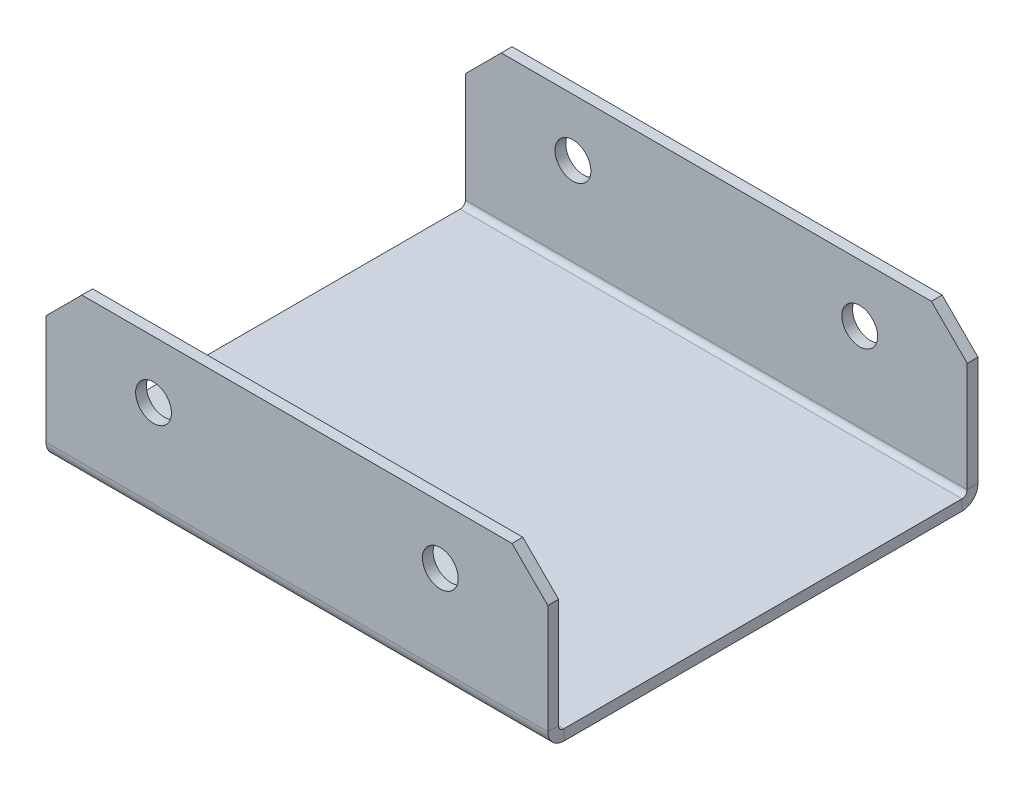
ISO-10303-21;
HEADER;
FILE_DESCRIPTION(('STEP AP214'),'2;1');
FILE_NAME('part.step','',(''),(''),'','','');
FILE_SCHEMA(('AUTOMOTIVE_DESIGN { 1 0 10303 214 1 1 1 1 }'));
ENDSEC;
DATA;
#1=APPLICATION_CONTEXT('core data for automotive mechanical design processes');
#2=APPLICATION_PROTOCOL_DEFINITION('international standard','automotive_design',2000,#1);
#3=PRODUCT_CONTEXT('',#1,'mechanical');
#4=PRODUCT('Part','Part','',(#3));
#5=PRODUCT_RELATED_PRODUCT_CATEGORY('part','',(#4));
#6=PRODUCT_DEFINITION_FORMATION('','',#4);
#7=PRODUCT_DEFINITION_CONTEXT('part definition',#1,'design');
#8=PRODUCT_DEFINITION('design','',#6,#7);
#9=PRODUCT_DEFINITION_SHAPE('','',#8);
#10=(LENGTH_UNIT() NAMED_UNIT(*) SI_UNIT(.MILLI.,.METRE.));
#11=(NAMED_UNIT(*) PLANE_ANGLE_UNIT() SI_UNIT($,.RADIAN.));
#12=(NAMED_UNIT(*) SI_UNIT($,.STERADIAN.) SOLID_ANGLE_UNIT());
#13=UNCERTAINTY_MEASURE_WITH_UNIT(LENGTH_MEASURE(1.E-05),#10,'distance_accuracy_value','');
#14=(GEOMETRIC_REPRESENTATION_CONTEXT(3) GLOBAL_UNCERTAINTY_ASSIGNED_CONTEXT((#13)) GLOBAL_UNIT_ASSIGNED_CONTEXT((#10,
#11,#12)) REPRESENTATION_CONTEXT('',''));
#15=CARTESIAN_POINT('',(0.,0.,0.));
#16=DIRECTION('',(0.,0.,1.));
#17=DIRECTION('',(1.,0.,0.));
#18=AXIS2_PLACEMENT_3D('',#15,#16,#17);
#19=CARTESIAN_POINT('',(0.,-1.5,0.));
#20=DIRECTION('',(0.,1.,0.));
#21=DIRECTION('',(0.,0.,1.));
#22=AXIS2_PLACEMENT_3D('',#19,#20,#21);
#23=PLANE('',#22);
#24=DIRECTION('',(-1.,0.,0.));
#25=VECTOR('',#24,1.);
#26=CARTESIAN_POINT('',(-35.,-1.50000000000001,-27.7634));
#27=LINE('',#26,#25);
#28=CARTESIAN_POINT('',(-35.,-1.50000000000001,-27.7634));
#29=VERTEX_POINT('',#28);
#30=CARTESIAN_POINT('',(35.,-1.5,-27.7634));
#31=VERTEX_POINT('',#30);
#32=EDGE_CURVE('E203',#29,#31,#27,.F.);
#33=ORIENTED_EDGE('',*,*,#32,.T.);
#34=DIRECTION('',(0.,0.,-1.));
#35=VECTOR('',#34,1.);
#36=CARTESIAN_POINT('',(35.,-1.5,30.));
#37=LINE('',#36,#35);
#38=CARTESIAN_POINT('',(35.,-1.5,27.7634));
#39=VERTEX_POINT('',#38);
#40=EDGE_CURVE('E310',#39,#31,#37,.T.);
#41=ORIENTED_EDGE('',*,*,#40,.F.);
#42=DIRECTION('',(1.,0.,0.));
#43=VECTOR('',#42,1.);
#44=CARTESIAN_POINT('',(35.,-1.5,27.7634));
#45=LINE('',#44,#43);
#46=CARTESIAN_POINT('',(-35.,-1.5,27.7634));
#47=VERTEX_POINT('',#46);
#48=EDGE_CURVE('E284',#39,#47,#45,.F.);
#49=ORIENTED_EDGE('',*,*,#48,.T.);
#50=DIRECTION('',(0.,0.,1.));
#51=VECTOR('',#50,1.);
#52=CARTESIAN_POINT('',(-35.,-1.5,30.));
#53=LINE('',#52,#51);
#54=EDGE_CURVE('E308',#29,#47,#53,.T.);
#55=ORIENTED_EDGE('',*,*,#54,.F.);
#56=EDGE_LOOP('',(#33,#41,#49,#55));
#57=FACE_BOUND('',#56,.T.);
#58=ADVANCED_FACE('F79',(#57),#23,.F.);
#59=CARTESIAN_POINT('',(0.,0.,0.));
#60=DIRECTION('',(0.,1.,0.));
#61=DIRECTION('',(0.,0.,1.));
#62=AXIS2_PLACEMENT_3D('',#59,#60,#61);
#63=PLANE('',#62);
#64=DIRECTION('',(0.,0.,-1.));
#65=VECTOR('',#64,1.);
#66=CARTESIAN_POINT('',(35.,0.,30.));
#67=LINE('',#66,#65);
#68=CARTESIAN_POINT('',(35.,0.,27.7634));
#69=VERTEX_POINT('',#68);
#70=CARTESIAN_POINT('',(35.,0.,-27.7634));
#71=VERTEX_POINT('',#70);
#72=EDGE_CURVE('E311',#69,#71,#67,.T.);
#73=ORIENTED_EDGE('',*,*,#72,.T.);
#74=DIRECTION('',(-1.,0.,0.));
#75=VECTOR('',#74,1.);
#76=CARTESIAN_POINT('',(-35.,0.,-27.7634));
#77=LINE('',#76,#75);
#78=CARTESIAN_POINT('',(-35.,0.,-27.7634));
#79=VERTEX_POINT('',#78);
#80=EDGE_CURVE('E247',#79,#71,#77,.F.);
#81=ORIENTED_EDGE('',*,*,#80,.F.);
#82=DIRECTION('',(0.,0.,1.));
#83=VECTOR('',#82,1.);
#84=CARTESIAN_POINT('',(-35.,0.,30.));
#85=LINE('',#84,#83);
#86=CARTESIAN_POINT('',(-35.,0.,27.7634));
#87=VERTEX_POINT('',#86);
#88=EDGE_CURVE('E305',#79,#87,#85,.T.);
#89=ORIENTED_EDGE('',*,*,#88,.T.);
#90=DIRECTION('',(1.,0.,0.));
#91=VECTOR('',#90,1.);
#92=CARTESIAN_POINT('',(35.,0.,27.7634));
#93=LINE('',#92,#91);
#94=EDGE_CURVE('E297',#69,#87,#93,.F.);
#95=ORIENTED_EDGE('',*,*,#94,.F.);
#96=EDGE_LOOP('',(#73,#81,#89,#95));
#97=FACE_BOUND('',#96,.T.);
#98=ADVANCED_FACE('F409',(#97),#63,.T.);
#99=CARTESIAN_POINT('',(-35.,-1.5,30.));
#100=DIRECTION('',(-1.,0.,0.));
#101=DIRECTION('',(0.,0.,1.));
#102=AXIS2_PLACEMENT_3D('',#99,#100,#101);
#103=PLANE('',#102);
#104=ORIENTED_EDGE('',*,*,#88,.F.);
#105=DIRECTION('',(0.,-1.,0.));
#106=VECTOR('',#105,1.);
#107=CARTESIAN_POINT('',(-35.,0.,-27.7634));
#108=LINE('',#107,#106);
#109=EDGE_CURVE('E243',#79,#29,#108,.T.);
#110=ORIENTED_EDGE('',*,*,#109,.T.);
#111=ORIENTED_EDGE('',*,*,#54,.T.);
#112=DIRECTION('',(0.,-1.,0.));
#113=VECTOR('',#112,1.);
#114=CARTESIAN_POINT('',(-35.,0.,27.7634));
#115=LINE('',#114,#113);
#116=EDGE_CURVE('E302',#87,#47,#115,.T.);
#117=ORIENTED_EDGE('',*,*,#116,.F.);
#118=EDGE_LOOP('',(#104,#110,#111,#117));
#119=FACE_BOUND('',#118,.T.);
#120=ADVANCED_FACE('F415',(#119),#103,.T.);
#121=CARTESIAN_POINT('',(35.,-1.5,30.));
#122=DIRECTION('',(1.,0.,0.));
#123=DIRECTION('',(0.,0.,-1.));
#124=AXIS2_PLACEMENT_3D('',#121,#122,#123);
#125=PLANE('',#124);
#126=DIRECTION('',(0.,-1.,0.));
#127=VECTOR('',#126,1.);
#128=CARTESIAN_POINT('',(35.,0.,-27.7634));
#129=LINE('',#128,#127);
#130=EDGE_CURVE('E251',#71,#31,#129,.T.);
#131=ORIENTED_EDGE('',*,*,#130,.F.);
#132=ORIENTED_EDGE('',*,*,#72,.F.);
#133=DIRECTION('',(0.,-1.,0.));
#134=VECTOR('',#133,1.);
#135=CARTESIAN_POINT('',(35.,0.,27.7634));
#136=LINE('',#135,#134);
#137=EDGE_CURVE('E291',#69,#39,#136,.T.);
#138=ORIENTED_EDGE('',*,*,#137,.T.);
#139=ORIENTED_EDGE('',*,*,#40,.T.);
#140=EDGE_LOOP('',(#131,#132,#138,#139));
#141=FACE_BOUND('',#140,.T.);
#142=ADVANCED_FACE('F422',(#141),#125,.T.);
#143=CARTESIAN_POINT('',(-35.,0.736599999999997,27.7634));
#144=DIRECTION('',(-1.,0.,0.));
#145=DIRECTION('',(0.,0.,1.));
#146=AXIS2_PLACEMENT_3D('',#143,#144,#145);
#147=PLANE('',#146);
#148=DIRECTION('',(0.,0.,-1.));
#149=VECTOR('',#148,1.);
#150=CARTESIAN_POINT('',(-35.,0.736599999999997,30.));
#151=LINE('',#150,#149);
#152=CARTESIAN_POINT('',(-35.,0.736599999999997,28.5));
#153=VERTEX_POINT('',#152);
#154=CARTESIAN_POINT('',(-35.,0.736599999999997,30.));
#155=VERTEX_POINT('',#154);
#156=EDGE_CURVE('E254',#153,#155,#151,.F.);
#157=ORIENTED_EDGE('',*,*,#156,.F.);
#158=CARTESIAN_POINT('',(-35.,0.736599999999997,27.7634));
#159=DIRECTION('',(1.,0.,0.));
#160=DIRECTION('',(0.,0.,-1.));
#161=AXIS2_PLACEMENT_3D('',#158,#159,#160);
#162=CIRCLE('',#161,0.7366);
#163=EDGE_CURVE('E294',#87,#153,#162,.F.);
#164=ORIENTED_EDGE('',*,*,#163,.F.);
#165=ORIENTED_EDGE('',*,*,#116,.T.);
#166=CARTESIAN_POINT('',(-35.,0.736599999999997,27.7634));
#167=DIRECTION('',(1.,0.,0.));
#168=DIRECTION('',(0.,0.,-1.));
#169=AXIS2_PLACEMENT_3D('',#166,#167,#168);
#170=CIRCLE('',#169,2.2366);
#171=EDGE_CURVE('E287',#47,#155,#170,.F.);
#172=ORIENTED_EDGE('',*,*,#171,.T.);
#173=EDGE_LOOP('',(#157,#164,#165,#172));
#174=FACE_BOUND('',#173,.T.);
#175=ADVANCED_FACE('F425',(#174),#147,.T.);
#176=CARTESIAN_POINT('',(35.,0.736599999999997,27.7634));
#177=DIRECTION('',(-1.,0.,0.));
#178=DIRECTION('',(0.,0.,1.));
#179=AXIS2_PLACEMENT_3D('',#176,#177,#178);
#180=PLANE('',#179);
#181=CARTESIAN_POINT('',(35.,0.736599999999997,27.7634));
#182=DIRECTION('',(1.,0.,0.));
#183=DIRECTION('',(0.,0.,-1.));
#184=AXIS2_PLACEMENT_3D('',#181,#182,#183);
#185=CIRCLE('',#184,0.7366);
#186=CARTESIAN_POINT('',(35.,0.736599999999997,28.5));
#187=VERTEX_POINT('',#186);
#188=EDGE_CURVE('E260',#187,#69,#185,.T.);
#189=ORIENTED_EDGE('',*,*,#188,.F.);
#190=DIRECTION('',(0.,0.,-1.));
#191=VECTOR('',#190,1.);
#192=CARTESIAN_POINT('',(35.,0.736599999999997,28.5));
#193=LINE('',#192,#191);
#194=CARTESIAN_POINT('',(35.,0.736599999999997,30.));
#195=VERTEX_POINT('',#194);
#196=EDGE_CURVE('E277',#187,#195,#193,.F.);
#197=ORIENTED_EDGE('',*,*,#196,.T.);
#198=CARTESIAN_POINT('',(35.,0.736599999999997,27.7634));
#199=DIRECTION('',(1.,0.,0.));
#200=DIRECTION('',(0.,0.,-1.));
#201=AXIS2_PLACEMENT_3D('',#198,#199,#200);
#202=CIRCLE('',#201,2.2366);
#203=EDGE_CURVE('E288',#195,#39,#202,.T.);
#204=ORIENTED_EDGE('',*,*,#203,.T.);
#205=ORIENTED_EDGE('',*,*,#137,.F.);
#206=EDGE_LOOP('',(#189,#197,#204,#205));
#207=FACE_BOUND('',#206,.T.);
#208=ADVANCED_FACE('F419',(#207),#180,.F.);
#209=CARTESIAN_POINT('',(35.,0.736599999999997,27.7634));
#210=DIRECTION('',(1.,0.,0.));
#211=DIRECTION('',(0.,0.,1.));
#212=AXIS2_PLACEMENT_3D('',#209,#210,#211);
#213=CYLINDRICAL_SURFACE('',#212,2.2366);
#214=ORIENTED_EDGE('',*,*,#48,.F.);
#215=ORIENTED_EDGE('',*,*,#203,.F.);
#216=DIRECTION('',(1.,0.,0.));
#217=VECTOR('',#216,1.);
#218=CARTESIAN_POINT('',(-35.,0.736599999999997,30.));
#219=LINE('',#218,#217);
#220=EDGE_CURVE('E274',#195,#155,#219,.F.);
#221=ORIENTED_EDGE('',*,*,#220,.T.);
#222=ORIENTED_EDGE('',*,*,#171,.F.);
#223=EDGE_LOOP('',(#214,#215,#221,#222));
#224=FACE_BOUND('',#223,.T.);
#225=ADVANCED_FACE('F482',(#224),#213,.T.);
#226=CARTESIAN_POINT('',(35.,0.736599999999997,27.7634));
#227=DIRECTION('',(1.,0.,0.));
#228=DIRECTION('',(0.,0.,1.));
#229=AXIS2_PLACEMENT_3D('',#226,#227,#228);
#230=CYLINDRICAL_SURFACE('',#229,0.7366);
#231=ORIENTED_EDGE('',*,*,#94,.T.);
#232=ORIENTED_EDGE('',*,*,#163,.T.);
#233=DIRECTION('',(1.,0.,0.));
#234=VECTOR('',#233,1.);
#235=CARTESIAN_POINT('',(-35.,0.736599999999997,28.5));
#236=LINE('',#235,#234);
#237=EDGE_CURVE('E280',#153,#187,#236,.T.);
#238=ORIENTED_EDGE('',*,*,#237,.T.);
#239=ORIENTED_EDGE('',*,*,#188,.T.);
#240=EDGE_LOOP('',(#231,#232,#238,#239));
#241=FACE_BOUND('',#240,.T.);
#242=ADVANCED_FACE('F470',(#241),#230,.F.);
#243=CARTESIAN_POINT('',(-35.,0.,30.));
#244=DIRECTION('',(1.,0.,0.));
#245=DIRECTION('',(0.,0.,-1.));
#246=AXIS2_PLACEMENT_3D('',#243,#244,#245);
#247=PLANE('',#246);
#248=DIRECTION('',(0.,-1.,0.));
#249=VECTOR('',#248,1.);
#250=CARTESIAN_POINT('',(-35.,0.,30.));
#251=LINE('',#250,#249);
#252=CARTESIAN_POINT('',(-35.,16.,30.));
#253=VERTEX_POINT('',#252);
#254=EDGE_CURVE('E264',#253,#155,#251,.T.);
#255=ORIENTED_EDGE('',*,*,#254,.F.);
#256=DIRECTION('',(0.,0.,-1.));
#257=VECTOR('',#256,1.);
#258=CARTESIAN_POINT('',(-35.,16.,30.));
#259=LINE('',#258,#257);
#260=CARTESIAN_POINT('',(-35.,16.,28.5));
#261=VERTEX_POINT('',#260);
#262=EDGE_CURVE('E326',#253,#261,#259,.T.);
#263=ORIENTED_EDGE('',*,*,#262,.T.);
#264=DIRECTION('',(0.,1.,0.));
#265=VECTOR('',#264,1.);
#266=CARTESIAN_POINT('',(-35.,0.,28.5));
#267=LINE('',#266,#265);
#268=EDGE_CURVE('E272',#261,#153,#267,.F.);
#269=ORIENTED_EDGE('',*,*,#268,.T.);
#270=ORIENTED_EDGE('',*,*,#156,.T.);
#271=EDGE_LOOP('',(#255,#263,#269,#270));
#272=FACE_BOUND('',#271,.T.);
#273=ADVANCED_FACE('F462',(#272),#247,.F.);
#274=CARTESIAN_POINT('',(35.,21.,30.));
#275=DIRECTION('',(-1.,0.,0.));
#276=DIRECTION('',(0.,-1.,0.));
#277=AXIS2_PLACEMENT_3D('',#274,#275,#276);
#278=PLANE('',#277);
#279=DIRECTION('',(0.,-1.,0.));
#280=VECTOR('',#279,1.);
#281=CARTESIAN_POINT('',(35.,21.,28.5));
#282=LINE('',#281,#280);
#283=CARTESIAN_POINT('',(35.,16.,28.5));
#284=VERTEX_POINT('',#283);
#285=EDGE_CURVE('E269',#187,#284,#282,.F.);
#286=ORIENTED_EDGE('',*,*,#285,.T.);
#287=DIRECTION('',(0.,0.,1.));
#288=VECTOR('',#287,1.);
#289=CARTESIAN_POINT('',(35.,16.,30.));
#290=LINE('',#289,#288);
#291=CARTESIAN_POINT('',(35.,16.,30.));
#292=VERTEX_POINT('',#291);
#293=EDGE_CURVE('E322',#284,#292,#290,.T.);
#294=ORIENTED_EDGE('',*,*,#293,.T.);
#295=DIRECTION('',(0.,1.,0.));
#296=VECTOR('',#295,1.);
#297=CARTESIAN_POINT('',(35.,0.,30.));
#298=LINE('',#297,#296);
#299=EDGE_CURVE('E261',#195,#292,#298,.T.);
#300=ORIENTED_EDGE('',*,*,#299,.F.);
#301=ORIENTED_EDGE('',*,*,#196,.F.);
#302=EDGE_LOOP('',(#286,#294,#300,#301));
#303=FACE_BOUND('',#302,.T.);
#304=ADVANCED_FACE('F477',(#303),#278,.F.);
#305=CARTESIAN_POINT('',(0.,0.,30.));
#306=DIRECTION('',(0.,0.,-1.));
#307=DIRECTION('',(-1.,0.,0.));
#308=AXIS2_PLACEMENT_3D('',#305,#306,#307);
#309=PLANE('',#308);
#310=CARTESIAN_POINT('',(20.,13.,30.));
#311=DIRECTION('',(0.,0.,1.));
#312=DIRECTION('',(1.,0.,0.));
#313=AXIS2_PLACEMENT_3D('',#310,#311,#312);
#314=CIRCLE('',#313,2.5);
#315=CARTESIAN_POINT('',(22.5,13.,30.));
#316=VERTEX_POINT('',#315);
#317=EDGE_CURVE('E359',#316,#316,#314,.T.);
#318=ORIENTED_EDGE('',*,*,#317,.F.);
#319=EDGE_LOOP('',(#318));
#320=FACE_BOUND('',#319,.T.);
#321=CARTESIAN_POINT('',(-20.,13.,30.));
#322=DIRECTION('',(0.,0.,1.));
#323=DIRECTION('',(1.,0.,0.));
#324=AXIS2_PLACEMENT_3D('',#321,#322,#323);
#325=CIRCLE('',#324,2.5);
#326=CARTESIAN_POINT('',(-17.5,13.,30.));
#327=VERTEX_POINT('',#326);
#328=EDGE_CURVE('E364',#327,#327,#325,.T.);
#329=ORIENTED_EDGE('',*,*,#328,.F.);
#330=EDGE_LOOP('',(#329));
#331=FACE_BOUND('',#330,.T.);
#332=DIRECTION('',(-1.,0.,0.));
#333=VECTOR('',#332,1.);
#334=CARTESIAN_POINT('',(0.,21.,30.));
#335=LINE('',#334,#333);
#336=CARTESIAN_POINT('',(30.,21.,30.));
#337=VERTEX_POINT('',#336);
#338=CARTESIAN_POINT('',(-30.,21.,30.));
#339=VERTEX_POINT('',#338);
#340=EDGE_CURVE('E257',#337,#339,#335,.T.);
#341=ORIENTED_EDGE('',*,*,#340,.T.);
#342=DIRECTION('',(0.707106781186548,0.707106781186548,0.));
#343=VECTOR('',#342,1.);
#344=CARTESIAN_POINT('',(-35.,16.,30.));
#345=LINE('',#344,#343);
#346=EDGE_CURVE('E333',#339,#253,#345,.F.);
#347=ORIENTED_EDGE('',*,*,#346,.T.);
#348=ORIENTED_EDGE('',*,*,#254,.T.);
#349=ORIENTED_EDGE('',*,*,#220,.F.);
#350=ORIENTED_EDGE('',*,*,#299,.T.);
#351=DIRECTION('',(0.707106781186548,-0.707106781186547,0.));
#352=VECTOR('',#351,1.);
#353=CARTESIAN_POINT('',(30.,21.,30.));
#354=LINE('',#353,#352);
#355=EDGE_CURVE('E324',#292,#337,#354,.F.);
#356=ORIENTED_EDGE('',*,*,#355,.T.);
#357=EDGE_LOOP('',(#341,#347,#348,#349,#350,#356));
#358=FACE_BOUND('',#357,.T.);
#359=ADVANCED_FACE('F451',(#320,#331,#358),#309,.F.);
#360=CARTESIAN_POINT('',(0.,0.,28.5));
#361=DIRECTION('',(0.,0.,-1.));
#362=DIRECTION('',(-1.,0.,0.));
#363=AXIS2_PLACEMENT_3D('',#360,#361,#362);
#364=PLANE('',#363);
#365=CARTESIAN_POINT('',(20.,13.,28.5));
#366=DIRECTION('',(0.,0.,-1.));
#367=DIRECTION('',(-1.,0.,0.));
#368=AXIS2_PLACEMENT_3D('',#365,#366,#367);
#369=CIRCLE('',#368,2.5);
#370=CARTESIAN_POINT('',(17.5,13.,28.5));
#371=VERTEX_POINT('',#370);
#372=EDGE_CURVE('E240',#371,#371,#369,.T.);
#373=ORIENTED_EDGE('',*,*,#372,.F.);
#374=EDGE_LOOP('',(#373));
#375=FACE_BOUND('',#374,.T.);
#376=CARTESIAN_POINT('',(-20.,13.,28.5));
#377=DIRECTION('',(0.,0.,-1.));
#378=DIRECTION('',(-1.,0.,0.));
#379=AXIS2_PLACEMENT_3D('',#376,#377,#378);
#380=CIRCLE('',#379,2.5);
#381=CARTESIAN_POINT('',(-22.5,13.,28.5));
#382=VERTEX_POINT('',#381);
#383=EDGE_CURVE('E352',#382,#382,#380,.T.);
#384=ORIENTED_EDGE('',*,*,#383,.F.);
#385=EDGE_LOOP('',(#384));
#386=FACE_BOUND('',#385,.T.);
#387=ORIENTED_EDGE('',*,*,#268,.F.);
#388=DIRECTION('',(-0.707106781186548,-0.707106781186548,0.));
#389=VECTOR('',#388,1.);
#390=CARTESIAN_POINT('',(-25.5,25.5,28.5));
#391=LINE('',#390,#389);
#392=CARTESIAN_POINT('',(-30.,21.,28.5));
#393=VERTEX_POINT('',#392);
#394=EDGE_CURVE('E329',#261,#393,#391,.F.);
#395=ORIENTED_EDGE('',*,*,#394,.T.);
#396=DIRECTION('',(1.,0.,0.));
#397=VECTOR('',#396,1.);
#398=CARTESIAN_POINT('',(-35.,21.,28.5));
#399=LINE('',#398,#397);
#400=CARTESIAN_POINT('',(30.,21.,28.5));
#401=VERTEX_POINT('',#400);
#402=EDGE_CURVE('E266',#401,#393,#399,.F.);
#403=ORIENTED_EDGE('',*,*,#402,.F.);
#404=DIRECTION('',(-0.707106781186548,0.707106781186547,0.));
#405=VECTOR('',#404,1.);
#406=CARTESIAN_POINT('',(25.5,25.5,28.5));
#407=LINE('',#406,#405);
#408=EDGE_CURVE('E320',#401,#284,#407,.F.);
#409=ORIENTED_EDGE('',*,*,#408,.T.);
#410=ORIENTED_EDGE('',*,*,#285,.F.);
#411=ORIENTED_EDGE('',*,*,#237,.F.);
#412=EDGE_LOOP('',(#387,#395,#403,#409,#410,#411));
#413=FACE_BOUND('',#412,.T.);
#414=ADVANCED_FACE('F474',(#375,#386,#413),#364,.T.);
#415=CARTESIAN_POINT('',(-35.,21.,30.));
#416=DIRECTION('',(0.,-1.,0.));
#417=DIRECTION('',(0.,0.,-1.));
#418=AXIS2_PLACEMENT_3D('',#415,#416,#417);
#419=PLANE('',#418);
#420=ORIENTED_EDGE('',*,*,#402,.T.);
#421=DIRECTION('',(0.,0.,1.));
#422=VECTOR('',#421,1.);
#423=CARTESIAN_POINT('',(-30.,21.,30.));
#424=LINE('',#423,#422);
#425=EDGE_CURVE('E331',#393,#339,#424,.T.);
#426=ORIENTED_EDGE('',*,*,#425,.T.);
#427=ORIENTED_EDGE('',*,*,#340,.F.);
#428=DIRECTION('',(0.,0.,-1.));
#429=VECTOR('',#428,1.);
#430=CARTESIAN_POINT('',(30.,21.,30.));
#431=LINE('',#430,#429);
#432=EDGE_CURVE('E314',#337,#401,#431,.T.);
#433=ORIENTED_EDGE('',*,*,#432,.T.);
#434=EDGE_LOOP('',(#420,#426,#427,#433));
#435=FACE_BOUND('',#434,.T.);
#436=ADVANCED_FACE('F456',(#435),#419,.F.);
#437=CARTESIAN_POINT('',(35.,0.736599999999993,-27.7634));
#438=DIRECTION('',(1.,0.,0.));
#439=DIRECTION('',(0.,1.,0.));
#440=AXIS2_PLACEMENT_3D('',#437,#438,#439);
#441=PLANE('',#440);
#442=DIRECTION('',(0.,0.,1.));
#443=VECTOR('',#442,1.);
#444=CARTESIAN_POINT('',(35.,0.736600000000007,-30.));
#445=LINE('',#444,#443);
#446=CARTESIAN_POINT('',(35.,0.73659999999999,-28.5));
#447=VERTEX_POINT('',#446);
#448=CARTESIAN_POINT('',(35.,0.736599999999985,-30.));
#449=VERTEX_POINT('',#448);
#450=EDGE_CURVE('E237',#447,#449,#445,.F.);
#451=ORIENTED_EDGE('',*,*,#450,.F.);
#452=CARTESIAN_POINT('',(35.,0.736599999999993,-27.7634));
#453=DIRECTION('',(-1.,0.,0.));
#454=DIRECTION('',(0.,-1.,0.));
#455=AXIS2_PLACEMENT_3D('',#452,#453,#454);
#456=CIRCLE('',#455,0.7366);
#457=EDGE_CURVE('E206',#71,#447,#456,.F.);
#458=ORIENTED_EDGE('',*,*,#457,.F.);
#459=ORIENTED_EDGE('',*,*,#130,.T.);
#460=CARTESIAN_POINT('',(35.,0.736599999999993,-27.7634));
#461=DIRECTION('',(-1.,0.,0.));
#462=DIRECTION('',(0.,-1.,0.));
#463=AXIS2_PLACEMENT_3D('',#460,#461,#462);
#464=CIRCLE('',#463,2.2366);
#465=EDGE_CURVE('E242',#31,#449,#464,.F.);
#466=ORIENTED_EDGE('',*,*,#465,.T.);
#467=EDGE_LOOP('',(#451,#458,#459,#466));
#468=FACE_BOUND('',#467,.T.);
#469=ADVANCED_FACE('F490',(#468),#441,.T.);
#470=CARTESIAN_POINT('',(-35.,0.736599999999988,-27.7634));
#471=DIRECTION('',(1.,0.,0.));
#472=DIRECTION('',(0.,1.,0.));
#473=AXIS2_PLACEMENT_3D('',#470,#471,#472);
#474=PLANE('',#473);
#475=CARTESIAN_POINT('',(-35.,0.736599999999988,-27.7634));
#476=DIRECTION('',(-1.,0.,0.));
#477=DIRECTION('',(0.,-1.,0.));
#478=AXIS2_PLACEMENT_3D('',#475,#476,#477);
#479=CIRCLE('',#478,0.7366);
#480=CARTESIAN_POINT('',(-35.,0.736599999999985,-28.5));
#481=VERTEX_POINT('',#480);
#482=EDGE_CURVE('E213',#481,#79,#479,.T.);
#483=ORIENTED_EDGE('',*,*,#482,.F.);
#484=DIRECTION('',(0.,0.,1.));
#485=VECTOR('',#484,1.);
#486=CARTESIAN_POINT('',(-35.,0.736599999999993,-28.5));
#487=LINE('',#486,#485);
#488=CARTESIAN_POINT('',(-35.,0.736600000000004,-30.));
#489=VERTEX_POINT('',#488);
#490=EDGE_CURVE('E210',#481,#489,#487,.F.);
#491=ORIENTED_EDGE('',*,*,#490,.T.);
#492=CARTESIAN_POINT('',(-35.,0.736599999999988,-27.7634));
#493=DIRECTION('',(-1.,0.,0.));
#494=DIRECTION('',(0.,-1.,0.));
#495=AXIS2_PLACEMENT_3D('',#492,#493,#494);
#496=CIRCLE('',#495,2.2366);
#497=EDGE_CURVE('E196',#489,#29,#496,.T.);
#498=ORIENTED_EDGE('',*,*,#497,.T.);
#499=ORIENTED_EDGE('',*,*,#109,.F.);
#500=EDGE_LOOP('',(#483,#491,#498,#499));
#501=FACE_BOUND('',#500,.T.);
#502=ADVANCED_FACE('F211',(#501),#474,.F.);
#503=CARTESIAN_POINT('',(-35.,0.736599999999988,-27.7634));
#504=DIRECTION('',(-1.,0.,0.));
#505=DIRECTION('',(0.,0.,-1.));
#506=AXIS2_PLACEMENT_3D('',#503,#504,#505);
#507=CYLINDRICAL_SURFACE('',#506,2.2366);
#508=ORIENTED_EDGE('',*,*,#32,.F.);
#509=ORIENTED_EDGE('',*,*,#497,.F.);
#510=DIRECTION('',(-1.,0.,0.));
#511=VECTOR('',#510,1.);
#512=CARTESIAN_POINT('',(35.,0.736600000000007,-30.));
#513=LINE('',#512,#511);
#514=EDGE_CURVE('E201',#489,#449,#513,.F.);
#515=ORIENTED_EDGE('',*,*,#514,.T.);
#516=ORIENTED_EDGE('',*,*,#465,.F.);
#517=EDGE_LOOP('',(#508,#509,#515,#516));
#518=FACE_BOUND('',#517,.T.);
#519=ADVANCED_FACE('F198',(#518),#507,.T.);
#520=CARTESIAN_POINT('',(-35.,0.736599999999988,-27.7634));
#521=DIRECTION('',(-1.,0.,0.));
#522=DIRECTION('',(0.,0.,-1.));
#523=AXIS2_PLACEMENT_3D('',#520,#521,#522);
#524=CYLINDRICAL_SURFACE('',#523,0.7366);
#525=ORIENTED_EDGE('',*,*,#80,.T.);
#526=ORIENTED_EDGE('',*,*,#457,.T.);
#527=DIRECTION('',(-1.,0.,0.));
#528=VECTOR('',#527,1.);
#529=CARTESIAN_POINT('',(35.,0.736599999999997,-28.5));
#530=LINE('',#529,#528);
#531=EDGE_CURVE('E214',#447,#481,#530,.T.);
#532=ORIENTED_EDGE('',*,*,#531,.T.);
#533=ORIENTED_EDGE('',*,*,#482,.T.);
#534=EDGE_LOOP('',(#525,#526,#532,#533));
#535=FACE_BOUND('',#534,.T.);
#536=ADVANCED_FACE('F486',(#535),#524,.F.);
#537=CARTESIAN_POINT('',(35.,0.,-30.));
#538=DIRECTION('',(-1.,0.,0.));
#539=DIRECTION('',(0.,0.,1.));
#540=AXIS2_PLACEMENT_3D('',#537,#538,#539);
#541=PLANE('',#540);
#542=DIRECTION('',(0.,-1.,0.));
#543=VECTOR('',#542,1.);
#544=CARTESIAN_POINT('',(35.,-1.09320630566873E-13,-30.));
#545=LINE('',#544,#543);
#546=CARTESIAN_POINT('',(35.,16.,-30.));
#547=VERTEX_POINT('',#546);
#548=EDGE_CURVE('E221',#547,#449,#545,.T.);
#549=ORIENTED_EDGE('',*,*,#548,.F.);
#550=DIRECTION('',(0.,0.,1.));
#551=VECTOR('',#550,1.);
#552=CARTESIAN_POINT('',(35.,16.,-30.));
#553=LINE('',#552,#551);
#554=CARTESIAN_POINT('',(35.,16.,-28.5));
#555=VERTEX_POINT('',#554);
#556=EDGE_CURVE('E335',#547,#555,#553,.T.);
#557=ORIENTED_EDGE('',*,*,#556,.T.);
#558=DIRECTION('',(0.,1.,0.));
#559=VECTOR('',#558,1.);
#560=CARTESIAN_POINT('',(35.,0.,-28.5));
#561=LINE('',#560,#559);
#562=EDGE_CURVE('E222',#555,#447,#561,.F.);
#563=ORIENTED_EDGE('',*,*,#562,.T.);
#564=ORIENTED_EDGE('',*,*,#450,.T.);
#565=EDGE_LOOP('',(#549,#557,#563,#564));
#566=FACE_BOUND('',#565,.T.);
#567=ADVANCED_FACE('F394',(#566),#541,.F.);
#568=CARTESIAN_POINT('',(-35.,21.,-30.0000000000001));
#569=DIRECTION('',(1.,0.,0.));
#570=DIRECTION('',(0.,1.,0.));
#571=AXIS2_PLACEMENT_3D('',#568,#569,#570);
#572=PLANE('',#571);
#573=DIRECTION('',(0.,-1.,0.));
#574=VECTOR('',#573,1.);
#575=CARTESIAN_POINT('',(-35.,21.,-28.5000000000001));
#576=LINE('',#575,#574);
#577=CARTESIAN_POINT('',(-35.,16.,-28.5));
#578=VERTEX_POINT('',#577);
#579=EDGE_CURVE('E233',#481,#578,#576,.F.);
#580=ORIENTED_EDGE('',*,*,#579,.T.);
#581=DIRECTION('',(0.,0.,-1.));
#582=VECTOR('',#581,1.);
#583=CARTESIAN_POINT('',(-35.,16.,-30.));
#584=LINE('',#583,#582);
#585=CARTESIAN_POINT('',(-35.,16.,-30.));
#586=VERTEX_POINT('',#585);
#587=EDGE_CURVE('E89',#578,#586,#584,.T.);
#588=ORIENTED_EDGE('',*,*,#587,.T.);
#589=DIRECTION('',(0.,1.,0.));
#590=VECTOR('',#589,1.);
#591=CARTESIAN_POINT('',(-35.,-1.20885453740052E-13,-30.));
#592=LINE('',#591,#590);
#593=EDGE_CURVE('E218',#489,#586,#592,.T.);
#594=ORIENTED_EDGE('',*,*,#593,.F.);
#595=ORIENTED_EDGE('',*,*,#490,.F.);
#596=EDGE_LOOP('',(#580,#588,#594,#595));
#597=FACE_BOUND('',#596,.T.);
#598=ADVANCED_FACE('F224',(#597),#572,.F.);
#599=CARTESIAN_POINT('',(0.,-1.09320630566873E-13,-30.));
#600=DIRECTION('',(0.,0.,1.));
#601=DIRECTION('',(0.,-1.,0.));
#602=AXIS2_PLACEMENT_3D('',#599,#600,#601);
#603=PLANE('',#602);
#604=CARTESIAN_POINT('',(20.,13.,-30.));
#605=DIRECTION('',(0.,0.,1.));
#606=DIRECTION('',(0.,-1.,0.));
#607=AXIS2_PLACEMENT_3D('',#604,#605,#606);
#608=CIRCLE('',#607,2.5);
#609=CARTESIAN_POINT('',(20.,10.5,-30.));
#610=VERTEX_POINT('',#609);
#611=EDGE_CURVE('E353',#610,#610,#608,.F.);
#612=ORIENTED_EDGE('',*,*,#611,.F.);
#613=EDGE_LOOP('',(#612));
#614=FACE_BOUND('',#613,.T.);
#615=CARTESIAN_POINT('',(-20.,13.,-30.));
#616=DIRECTION('',(0.,0.,1.));
#617=DIRECTION('',(0.,-1.,0.));
#618=AXIS2_PLACEMENT_3D('',#615,#616,#617);
#619=CIRCLE('',#618,2.5);
#620=CARTESIAN_POINT('',(-20.,10.5,-30.));
#621=VERTEX_POINT('',#620);
#622=EDGE_CURVE('E367',#621,#621,#619,.F.);
#623=ORIENTED_EDGE('',*,*,#622,.F.);
#624=EDGE_LOOP('',(#623));
#625=FACE_BOUND('',#624,.T.);
#626=ORIENTED_EDGE('',*,*,#593,.T.);
#627=DIRECTION('',(-0.707106781186548,-0.707106781186547,0.));
#628=VECTOR('',#627,1.);
#629=CARTESIAN_POINT('',(-30.,21.,-30.0000000000001));
#630=LINE('',#629,#628);
#631=CARTESIAN_POINT('',(-30.,21.,-30.0000000000001));
#632=VERTEX_POINT('',#631);
#633=EDGE_CURVE('E13',#586,#632,#630,.F.);
#634=ORIENTED_EDGE('',*,*,#633,.T.);
#635=DIRECTION('',(1.,0.,0.));
#636=VECTOR('',#635,1.);
#637=CARTESIAN_POINT('',(0.,21.,-30.0000000000001));
#638=LINE('',#637,#636);
#639=CARTESIAN_POINT('',(30.,21.,-30.0000000000001));
#640=VERTEX_POINT('',#639);
#641=EDGE_CURVE('E225',#632,#640,#638,.T.);
#642=ORIENTED_EDGE('',*,*,#641,.T.);
#643=DIRECTION('',(-0.707106781186548,0.707106781186548,0.));
#644=VECTOR('',#643,1.);
#645=CARTESIAN_POINT('',(35.,16.,-30.));
#646=LINE('',#645,#644);
#647=EDGE_CURVE('E344',#640,#547,#646,.F.);
#648=ORIENTED_EDGE('',*,*,#647,.T.);
#649=ORIENTED_EDGE('',*,*,#548,.T.);
#650=ORIENTED_EDGE('',*,*,#514,.F.);
#651=EDGE_LOOP('',(#626,#634,#642,#648,#649,#650));
#652=FACE_BOUND('',#651,.T.);
#653=ADVANCED_FACE('F217',(#614,#625,#652),#603,.F.);
#654=CARTESIAN_POINT('',(0.,-1.04083408558608E-13,-28.5));
#655=DIRECTION('',(0.,0.,1.));
#656=DIRECTION('',(0.,-1.,0.));
#657=AXIS2_PLACEMENT_3D('',#654,#655,#656);
#658=PLANE('',#657);
#659=CARTESIAN_POINT('',(20.,13.,-28.5));
#660=DIRECTION('',(0.,0.,1.));
#661=DIRECTION('',(0.,-1.,0.));
#662=AXIS2_PLACEMENT_3D('',#659,#660,#661);
#663=CIRCLE('',#662,2.5);
#664=CARTESIAN_POINT('',(20.,10.5,-28.5));
#665=VERTEX_POINT('',#664);
#666=EDGE_CURVE('E84',#665,#665,#663,.T.);
#667=ORIENTED_EDGE('',*,*,#666,.F.);
#668=EDGE_LOOP('',(#667));
#669=FACE_BOUND('',#668,.T.);
#670=CARTESIAN_POINT('',(-20.,13.,-28.5));
#671=DIRECTION('',(0.,0.,1.));
#672=DIRECTION('',(0.,-1.,0.));
#673=AXIS2_PLACEMENT_3D('',#670,#671,#672);
#674=CIRCLE('',#673,2.5);
#675=CARTESIAN_POINT('',(-20.,10.5,-28.5));
#676=VERTEX_POINT('',#675);
#677=EDGE_CURVE('E350',#676,#676,#674,.T.);
#678=ORIENTED_EDGE('',*,*,#677,.F.);
#679=EDGE_LOOP('',(#678));
#680=FACE_BOUND('',#679,.T.);
#681=DIRECTION('',(-1.,0.,0.));
#682=VECTOR('',#681,1.);
#683=CARTESIAN_POINT('',(35.,21.,-28.5000000000001));
#684=LINE('',#683,#682);
#685=CARTESIAN_POINT('',(-30.,21.,-28.5000000000001));
#686=VERTEX_POINT('',#685);
#687=CARTESIAN_POINT('',(30.,21.,-28.5000000000001));
#688=VERTEX_POINT('',#687);
#689=EDGE_CURVE('E228',#686,#688,#684,.F.);
#690=ORIENTED_EDGE('',*,*,#689,.F.);
#691=DIRECTION('',(0.707106781186548,0.707106781186547,0.));
#692=VECTOR('',#691,1.);
#693=CARTESIAN_POINT('',(-25.5,25.4999999999999,-28.5000000000001));
#694=LINE('',#693,#692);
#695=EDGE_CURVE('E104',#686,#578,#694,.F.);
#696=ORIENTED_EDGE('',*,*,#695,.T.);
#697=ORIENTED_EDGE('',*,*,#579,.F.);
#698=ORIENTED_EDGE('',*,*,#531,.F.);
#699=ORIENTED_EDGE('',*,*,#562,.F.);
#700=DIRECTION('',(0.707106781186548,-0.707106781186548,0.));
#701=VECTOR('',#700,1.);
#702=CARTESIAN_POINT('',(25.5,25.4999999999999,-28.5000000000001));
#703=LINE('',#702,#701);
#704=EDGE_CURVE('E338',#555,#688,#703,.F.);
#705=ORIENTED_EDGE('',*,*,#704,.T.);
#706=EDGE_LOOP('',(#690,#696,#697,#698,#699,#705));
#707=FACE_BOUND('',#706,.T.);
#708=ADVANCED_FACE('F379',(#669,#680,#707),#658,.T.);
#709=CARTESIAN_POINT('',(35.,21.,-30.0000000000001));
#710=DIRECTION('',(0.,-1.,0.));
#711=DIRECTION('',(0.,0.,-1.));
#712=AXIS2_PLACEMENT_3D('',#709,#710,#711);
#713=PLANE('',#712);
#714=ORIENTED_EDGE('',*,*,#641,.F.);
#715=DIRECTION('',(0.,0.,1.));
#716=VECTOR('',#715,1.);
#717=CARTESIAN_POINT('',(-30.,21.,-30.0000000000001));
#718=LINE('',#717,#716);
#719=EDGE_CURVE('E346',#632,#686,#718,.T.);
#720=ORIENTED_EDGE('',*,*,#719,.T.);
#721=ORIENTED_EDGE('',*,*,#689,.T.);
#722=DIRECTION('',(0.,0.,-1.));
#723=VECTOR('',#722,1.);
#724=CARTESIAN_POINT('',(30.,21.,-30.0000000000001));
#725=LINE('',#724,#723);
#726=EDGE_CURVE('E341',#688,#640,#725,.T.);
#727=ORIENTED_EDGE('',*,*,#726,.T.);
#728=EDGE_LOOP('',(#714,#720,#721,#727));
#729=FACE_BOUND('',#728,.T.);
#730=ADVANCED_FACE('F382',(#729),#713,.F.);
#731=CARTESIAN_POINT('',(30.,21.,30.));
#732=DIRECTION('',(-0.707106781186547,-0.707106781186548,0.));
#733=DIRECTION('',(0.,0.,-1.));
#734=AXIS2_PLACEMENT_3D('',#731,#732,#733);
#735=PLANE('',#734);
#736=ORIENTED_EDGE('',*,*,#355,.F.);
#737=ORIENTED_EDGE('',*,*,#293,.F.);
#738=ORIENTED_EDGE('',*,*,#408,.F.);
#739=ORIENTED_EDGE('',*,*,#432,.F.);
#740=EDGE_LOOP('',(#736,#737,#738,#739));
#741=FACE_BOUND('',#740,.T.);
#742=ADVANCED_FACE('F404',(#741),#735,.F.);
#743=CARTESIAN_POINT('',(-35.,16.,30.));
#744=DIRECTION('',(0.707106781186547,-0.707106781186547,0.));
#745=DIRECTION('',(0.,0.,-1.));
#746=AXIS2_PLACEMENT_3D('',#743,#744,#745);
#747=PLANE('',#746);
#748=ORIENTED_EDGE('',*,*,#346,.F.);
#749=ORIENTED_EDGE('',*,*,#425,.F.);
#750=ORIENTED_EDGE('',*,*,#394,.F.);
#751=ORIENTED_EDGE('',*,*,#262,.F.);
#752=EDGE_LOOP('',(#748,#749,#750,#751));
#753=FACE_BOUND('',#752,.T.);
#754=ADVANCED_FACE('F398',(#753),#747,.F.);
#755=CARTESIAN_POINT('',(35.,16.,-30.));
#756=DIRECTION('',(-0.707106781186547,-0.707106781186547,0.));
#757=DIRECTION('',(0.,0.,1.));
#758=AXIS2_PLACEMENT_3D('',#755,#756,#757);
#759=PLANE('',#758);
#760=ORIENTED_EDGE('',*,*,#647,.F.);
#761=ORIENTED_EDGE('',*,*,#726,.F.);
#762=ORIENTED_EDGE('',*,*,#704,.F.);
#763=ORIENTED_EDGE('',*,*,#556,.F.);
#764=EDGE_LOOP('',(#760,#761,#762,#763));
#765=FACE_BOUND('',#764,.T.);
#766=ADVANCED_FACE('F396',(#765),#759,.F.);
#767=CARTESIAN_POINT('',(-30.,21.,-30.0000000000001));
#768=DIRECTION('',(0.707106781186547,-0.707106781186548,0.));
#769=DIRECTION('',(0.,0.,1.));
#770=AXIS2_PLACEMENT_3D('',#767,#768,#769);
#771=PLANE('',#770);
#772=ORIENTED_EDGE('',*,*,#633,.F.);
#773=ORIENTED_EDGE('',*,*,#587,.F.);
#774=ORIENTED_EDGE('',*,*,#695,.F.);
#775=ORIENTED_EDGE('',*,*,#719,.F.);
#776=EDGE_LOOP('',(#772,#773,#774,#775));
#777=FACE_BOUND('',#776,.T.);
#778=ADVANCED_FACE('F82',(#777),#771,.F.);
#779=CARTESIAN_POINT('',(-20.,13.,-37.0710678118655));
#780=DIRECTION('',(0.,0.,1.));
#781=DIRECTION('',(1.,0.,0.));
#782=AXIS2_PLACEMENT_3D('',#779,#780,#781);
#783=CYLINDRICAL_SURFACE('',#782,2.5);
#784=ORIENTED_EDGE('',*,*,#677,.T.);
#785=EDGE_LOOP('',(#784));
#786=FACE_BOUND('',#785,.T.);
#787=ORIENTED_EDGE('',*,*,#622,.T.);
#788=EDGE_LOOP('',(#787));
#789=FACE_BOUND('',#788,.T.);
#790=ADVANCED_FACE('F403',(#786,#789),#783,.F.);
#791=CARTESIAN_POINT('',(20.,13.,-37.0710678118655));
#792=DIRECTION('',(0.,0.,1.));
#793=DIRECTION('',(1.,0.,0.));
#794=AXIS2_PLACEMENT_3D('',#791,#792,#793);
#795=CYLINDRICAL_SURFACE('',#794,2.5);
#796=ORIENTED_EDGE('',*,*,#666,.T.);
#797=EDGE_LOOP('',(#796));
#798=FACE_BOUND('',#797,.T.);
#799=ORIENTED_EDGE('',*,*,#611,.T.);
#800=EDGE_LOOP('',(#799));
#801=FACE_BOUND('',#800,.T.);
#802=ADVANCED_FACE('F377',(#798,#801),#795,.F.);
#803=ORIENTED_EDGE('',*,*,#383,.T.);
#804=EDGE_LOOP('',(#803));
#805=FACE_BOUND('',#804,.T.);
#806=ORIENTED_EDGE('',*,*,#328,.T.);
#807=EDGE_LOOP('',(#806));
#808=FACE_BOUND('',#807,.T.);
#809=ADVANCED_FACE('F618',(#805,#808),#783,.F.);
#810=ORIENTED_EDGE('',*,*,#372,.T.);
#811=EDGE_LOOP('',(#810));
#812=FACE_BOUND('',#811,.T.);
#813=ORIENTED_EDGE('',*,*,#317,.T.);
#814=EDGE_LOOP('',(#813));
#815=FACE_BOUND('',#814,.T.);
#816=ADVANCED_FACE('F625',(#812,#815),#795,.F.);
#817=CLOSED_SHELL('',(#58,#98,#120,#142,#175,#208,#225,#242,#273,#304,#359,#414,#436,#469,#502,
#519,#536,#567,#598,#653,#708,#730,#742,#754,#766,#778,#790,#802,#809,#816));
#818=MANIFOLD_SOLID_BREP('B2',#817);
#819=ADVANCED_BREP_SHAPE_REPRESENTATION('',(#18,#818),#14);
#820=SHAPE_DEFINITION_REPRESENTATION(#9,#819);
ENDSEC;
END-ISO-10303-21;
